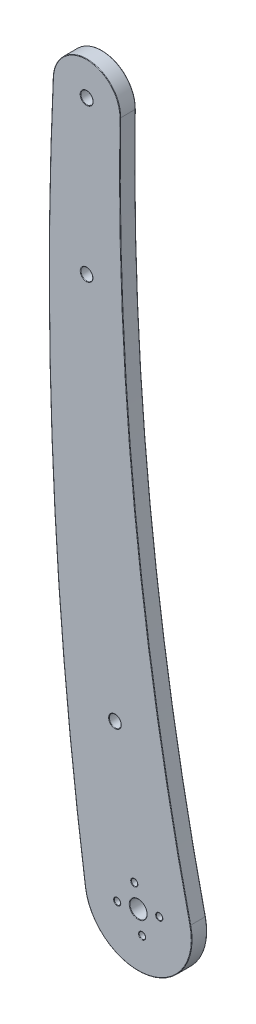
ISO-10303-21;
HEADER;
FILE_DESCRIPTION(('STEP AP214'),'2;1');
FILE_NAME('part.step','',(''),(''),'','','');
FILE_SCHEMA(('AUTOMOTIVE_DESIGN { 1 0 10303 214 1 1 1 1 }'));
ENDSEC;
DATA;
#1=APPLICATION_CONTEXT('core data for automotive mechanical design processes');
#2=APPLICATION_PROTOCOL_DEFINITION('international standard','automotive_design',2000,#1);
#3=PRODUCT_CONTEXT('',#1,'mechanical');
#4=PRODUCT('Part','Part','',(#3));
#5=PRODUCT_RELATED_PRODUCT_CATEGORY('part','',(#4));
#6=PRODUCT_DEFINITION_FORMATION('','',#4);
#7=PRODUCT_DEFINITION_CONTEXT('part definition',#1,'design');
#8=PRODUCT_DEFINITION('design','',#6,#7);
#9=PRODUCT_DEFINITION_SHAPE('','',#8);
#10=(LENGTH_UNIT() NAMED_UNIT(*) SI_UNIT(.MILLI.,.METRE.));
#11=(NAMED_UNIT(*) PLANE_ANGLE_UNIT() SI_UNIT($,.RADIAN.));
#12=(NAMED_UNIT(*) SI_UNIT($,.STERADIAN.) SOLID_ANGLE_UNIT());
#13=UNCERTAINTY_MEASURE_WITH_UNIT(LENGTH_MEASURE(1.E-05),#10,'distance_accuracy_value','');
#14=(GEOMETRIC_REPRESENTATION_CONTEXT(3) GLOBAL_UNCERTAINTY_ASSIGNED_CONTEXT((#13)) GLOBAL_UNIT_ASSIGNED_CONTEXT((#10,
#11,#12)) REPRESENTATION_CONTEXT('',''));
#15=CARTESIAN_POINT('',(0.,0.,0.));
#16=DIRECTION('',(0.,0.,1.));
#17=DIRECTION('',(1.,0.,0.));
#18=AXIS2_PLACEMENT_3D('',#15,#16,#17);
#19=CARTESIAN_POINT('',(-37.0776547455483,278.939028450343,-5.));
#20=DIRECTION('',(0.,0.,1.));
#21=DIRECTION('',(1.,0.,0.));
#22=AXIS2_PLACEMENT_3D('',#19,#20,#21);
#23=CYLINDRICAL_SURFACE('',#22,11.0000000000001);
#24=DIRECTION('',(0.,0.,1.));
#25=VECTOR('',#24,1.);
#26=CARTESIAN_POINT('',(-26.0791673880019,278.756611768298,-5.));
#27=LINE('',#26,#25);
#28=CARTESIAN_POINT('',(-26.0791673880019,278.756611768298,-4.85));
#29=VERTEX_POINT('',#28);
#30=CARTESIAN_POINT('',(-26.0791673880019,278.756611768298,-0.15));
#31=VERTEX_POINT('',#30);
#32=EDGE_CURVE('E107',#29,#31,#27,.T.);
#33=ORIENTED_EDGE('',*,*,#32,.F.);
#34=CARTESIAN_POINT('',(-37.0776547455483,278.939028450343,-4.85));
#35=DIRECTION('',(0.,0.,-1.));
#36=DIRECTION('',(-1.,0.,0.));
#37=AXIS2_PLACEMENT_3D('',#34,#35,#36);
#38=CIRCLE('',#37,11.0000000000001);
#39=CARTESIAN_POINT('',(-48.0655821267615,279.45424866073,-4.85));
#40=VERTEX_POINT('',#39);
#41=EDGE_CURVE('E102',#29,#40,#38,.F.);
#42=ORIENTED_EDGE('',*,*,#41,.T.);
#43=DIRECTION('',(0.,0.,1.));
#44=VECTOR('',#43,1.);
#45=CARTESIAN_POINT('',(-48.0655821267615,279.45424866073,-5.));
#46=LINE('',#45,#44);
#47=CARTESIAN_POINT('',(-48.0655821267615,279.45424866073,-0.15));
#48=VERTEX_POINT('',#47);
#49=EDGE_CURVE('E104',#40,#48,#46,.T.);
#50=ORIENTED_EDGE('',*,*,#49,.T.);
#51=CARTESIAN_POINT('',(-37.0776547455483,278.939028450343,-0.15));
#52=DIRECTION('',(0.,0.,-1.));
#53=DIRECTION('',(-1.,0.,0.));
#54=AXIS2_PLACEMENT_3D('',#51,#52,#53);
#55=CIRCLE('',#54,11.0000000000001);
#56=EDGE_CURVE('E113',#48,#31,#55,.T.);
#57=ORIENTED_EDGE('',*,*,#56,.T.);
#58=EDGE_LOOP('',(#33,#42,#50,#57));
#59=FACE_BOUND('',#58,.T.);
#60=ADVANCED_FACE('F36',(#59),#23,.T.);
#61=CARTESIAN_POINT('',(873.797070956716,263.831610510011,-5.));
#62=DIRECTION('',(0.,0.,1.));
#63=DIRECTION('',(1.,0.,0.));
#64=AXIS2_PLACEMENT_3D('',#61,#62,#63);
#65=CYLINDRICAL_SURFACE('',#64,900.);
#66=DIRECTION('',(0.,0.,1.));
#67=VECTOR('',#66,1.);
#68=CARTESIAN_POINT('',(-3.16790327875482,61.5139544238968,-5.));
#69=LINE('',#68,#67);
#70=CARTESIAN_POINT('',(-3.16790327875482,61.5139544238968,-4.85));
#71=VERTEX_POINT('',#70);
#72=CARTESIAN_POINT('',(-3.16790327875482,61.5139544238968,-0.15));
#73=VERTEX_POINT('',#72);
#74=EDGE_CURVE('E285',#71,#73,#69,.T.);
#75=ORIENTED_EDGE('',*,*,#74,.F.);
#76=CARTESIAN_POINT('',(873.797070956716,263.831610510011,-4.85));
#77=DIRECTION('',(0.,0.,-1.));
#78=DIRECTION('',(-1.,0.,0.));
#79=AXIS2_PLACEMENT_3D('',#76,#77,#78);
#80=CIRCLE('',#79,900.);
#81=EDGE_CURVE('E181',#71,#29,#80,.T.);
#82=ORIENTED_EDGE('',*,*,#81,.T.);
#83=ORIENTED_EDGE('',*,*,#32,.T.);
#84=CARTESIAN_POINT('',(873.797070956716,263.831610510011,-0.15));
#85=DIRECTION('',(0.,0.,-1.));
#86=DIRECTION('',(-1.,0.,0.));
#87=AXIS2_PLACEMENT_3D('',#84,#85,#86);
#88=CIRCLE('',#87,900.);
#89=EDGE_CURVE('E178',#31,#73,#88,.F.);
#90=ORIENTED_EDGE('',*,*,#89,.T.);
#91=EDGE_LOOP('',(#75,#82,#83,#90));
#92=FACE_BOUND('',#91,.T.);
#93=ADVANCED_FACE('F282',(#92),#65,.F.);
#94=CARTESIAN_POINT('',(-20.2199999999997,57.58,-5.));
#95=DIRECTION('',(0.,0.,1.));
#96=DIRECTION('',(1.,0.,0.));
#97=AXIS2_PLACEMENT_3D('',#94,#95,#96);
#98=CYLINDRICAL_SURFACE('',#97,17.4999999999997);
#99=DIRECTION('',(0.,0.,1.));
#100=VECTOR('',#99,1.);
#101=CARTESIAN_POINT('',(-37.5474034553959,55.1282476687248,-5.));
#102=LINE('',#101,#100);
#103=CARTESIAN_POINT('',(-37.5474034553959,55.1282476687248,-4.85));
#104=VERTEX_POINT('',#103);
#105=CARTESIAN_POINT('',(-37.5474034553959,55.1282476687248,-0.15));
#106=VERTEX_POINT('',#105);
#107=EDGE_CURVE('E124',#104,#106,#102,.T.);
#108=ORIENTED_EDGE('',*,*,#107,.F.);
#109=CARTESIAN_POINT('',(-20.2199999999997,57.58,-4.85));
#110=DIRECTION('',(0.,0.,-1.));
#111=DIRECTION('',(-1.,0.,0.));
#112=AXIS2_PLACEMENT_3D('',#109,#110,#111);
#113=CIRCLE('',#112,17.4999999999997);
#114=EDGE_CURVE('E176',#104,#71,#113,.F.);
#115=ORIENTED_EDGE('',*,*,#114,.T.);
#116=ORIENTED_EDGE('',*,*,#74,.T.);
#117=CARTESIAN_POINT('',(-20.2199999999997,57.58,-0.15));
#118=DIRECTION('',(0.,0.,-1.));
#119=DIRECTION('',(-1.,0.,0.));
#120=AXIS2_PLACEMENT_3D('',#117,#118,#119);
#121=CIRCLE('',#120,17.4999999999997);
#122=EDGE_CURVE('E174',#73,#106,#121,.T.);
#123=ORIENTED_EDGE('',*,*,#122,.T.);
#124=EDGE_LOOP('',(#108,#115,#116,#123));
#125=FACE_BOUND('',#124,.T.);
#126=ADVANCED_FACE('F337',(#125),#98,.T.);
#127=CARTESIAN_POINT('',(1150.61740491465,223.248407527602,-5.));
#128=DIRECTION('',(0.,0.,1.));
#129=DIRECTION('',(1.,0.,0.));
#130=AXIS2_PLACEMENT_3D('',#127,#128,#129);
#131=CYLINDRICAL_SURFACE('',#130,1200.);
#132=ORIENTED_EDGE('',*,*,#49,.F.);
#133=CARTESIAN_POINT('',(1150.61740491465,223.248407527602,-4.85));
#134=DIRECTION('',(0.,0.,-1.));
#135=DIRECTION('',(-1.,0.,0.));
#136=AXIS2_PLACEMENT_3D('',#133,#134,#135);
#137=CIRCLE('',#136,1200.);
#138=EDGE_CURVE('E120',#40,#104,#137,.F.);
#139=ORIENTED_EDGE('',*,*,#138,.T.);
#140=ORIENTED_EDGE('',*,*,#107,.T.);
#141=CARTESIAN_POINT('',(1150.61740491465,223.248407527602,-0.15));
#142=DIRECTION('',(0.,0.,-1.));
#143=DIRECTION('',(-1.,0.,0.));
#144=AXIS2_PLACEMENT_3D('',#141,#142,#143);
#145=CIRCLE('',#144,1200.);
#146=EDGE_CURVE('E123',#106,#48,#145,.T.);
#147=ORIENTED_EDGE('',*,*,#146,.T.);
#148=EDGE_LOOP('',(#132,#139,#140,#147));
#149=FACE_BOUND('',#148,.T.);
#150=ADVANCED_FACE('F117',(#149),#131,.T.);
#151=CARTESIAN_POINT('',(418.359708105584,271.385319480177,-5.));
#152=DIRECTION('',(0.,0.,-1.));
#153=DIRECTION('',(-1.,0.,0.));
#154=AXIS2_PLACEMENT_3D('',#151,#152,#153);
#155=PLANE('',#154);
#156=CARTESIAN_POINT('',(-20.2199999999997,57.58,-5.));
#157=DIRECTION('',(0.,0.,-1.));
#158=DIRECTION('',(-1.,0.,0.));
#159=AXIS2_PLACEMENT_3D('',#156,#157,#158);
#160=CIRCLE('',#159,17.3499999999997);
#161=CARTESIAN_POINT('',(-3.31406410779405,61.4802348145491,-5.));
#162=VERTEX_POINT('',#161);
#163=CARTESIAN_POINT('',(-37.3988828543496,55.1492626887071,-5.));
#164=VERTEX_POINT('',#163);
#165=EDGE_CURVE('E170',#162,#164,#160,.T.);
#166=ORIENTED_EDGE('',*,*,#165,.T.);
#167=CARTESIAN_POINT('',(1150.61740491465,223.248407527602,-5.));
#168=DIRECTION('',(0.,0.,-1.));
#169=DIRECTION('',(-1.,0.,0.));
#170=AXIS2_PLACEMENT_3D('',#167,#168,#169);
#171=CIRCLE('',#170,1199.85);
#172=CARTESIAN_POINT('',(-47.9157467533811,279.447222930589,-5.));
#173=VERTEX_POINT('',#172);
#174=EDGE_CURVE('E172',#164,#173,#171,.T.);
#175=ORIENTED_EDGE('',*,*,#174,.T.);
#176=CARTESIAN_POINT('',(-37.0776547455483,278.939028450343,-5.));
#177=DIRECTION('',(0.,0.,-1.));
#178=DIRECTION('',(-1.,0.,0.));
#179=AXIS2_PLACEMENT_3D('',#176,#177,#178);
#180=CIRCLE('',#179,10.8500000000001);
#181=CARTESIAN_POINT('',(-26.2291467610591,278.759099268507,-5.));
#182=VERTEX_POINT('',#181);
#183=EDGE_CURVE('E130',#173,#182,#180,.T.);
#184=ORIENTED_EDGE('',*,*,#183,.T.);
#185=CARTESIAN_POINT('',(873.797070956716,263.831610510011,-5.));
#186=DIRECTION('',(0.,0.,-1.));
#187=DIRECTION('',(-1.,0.,0.));
#188=AXIS2_PLACEMENT_3D('',#185,#186,#187);
#189=CIRCLE('',#188,900.15);
#190=EDGE_CURVE('E168',#182,#162,#189,.F.);
#191=ORIENTED_EDGE('',*,*,#190,.T.);
#192=EDGE_LOOP('',(#166,#175,#184,#191));
#193=FACE_BOUND('',#192,.T.);
#194=CARTESIAN_POINT('',(-20.2199999999997,57.58,-5.));
#195=DIRECTION('',(0.,0.,-1.));
#196=DIRECTION('',(-1.,0.,0.));
#197=AXIS2_PLACEMENT_3D('',#194,#195,#196);
#198=CIRCLE('',#197,2.95);
#199=CARTESIAN_POINT('',(-23.1699999999997,57.58,-5.));
#200=VERTEX_POINT('',#199);
#201=EDGE_CURVE('E164',#200,#200,#198,.F.);
#202=ORIENTED_EDGE('',*,*,#201,.T.);
#203=EDGE_LOOP('',(#202));
#204=FACE_BOUND('',#203,.T.);
#205=CARTESIAN_POINT('',(-37.0776547455483,278.939028450343,-5.));
#206=DIRECTION('',(0.,0.,-1.));
#207=DIRECTION('',(-1.,0.,0.));
#208=AXIS2_PLACEMENT_3D('',#205,#206,#207);
#209=CIRCLE('',#208,2.15);
#210=CARTESIAN_POINT('',(-39.2276547455483,278.939028450343,-5.));
#211=VERTEX_POINT('',#210);
#212=EDGE_CURVE('E161',#211,#211,#209,.F.);
#213=ORIENTED_EDGE('',*,*,#212,.T.);
#214=EDGE_LOOP('',(#213));
#215=FACE_BOUND('',#214,.T.);
#216=CARTESIAN_POINT('',(-27.8210123611365,106.998868978214,-5.));
#217=DIRECTION('',(0.,0.,-1.));
#218=DIRECTION('',(-1.,0.,0.));
#219=AXIS2_PLACEMENT_3D('',#216,#217,#218);
#220=CIRCLE('',#219,2.1);
#221=CARTESIAN_POINT('',(-29.9210123611365,106.998868978214,-5.));
#222=VERTEX_POINT('',#221);
#223=EDGE_CURVE('E158',#222,#222,#220,.F.);
#224=ORIENTED_EDGE('',*,*,#223,.T.);
#225=EDGE_LOOP('',(#224));
#226=FACE_BOUND('',#225,.T.);
#227=CARTESIAN_POINT('',(-37.1073977935269,228.939037296833,-5.));
#228=DIRECTION('',(0.,0.,-1.));
#229=DIRECTION('',(-1.,0.,0.));
#230=AXIS2_PLACEMENT_3D('',#227,#228,#229);
#231=CIRCLE('',#230,2.1);
#232=CARTESIAN_POINT('',(-39.2073977935269,228.939037296833,-5.));
#233=VERTEX_POINT('',#232);
#234=EDGE_CURVE('E155',#233,#233,#231,.F.);
#235=ORIENTED_EDGE('',*,*,#234,.T.);
#236=EDGE_LOOP('',(#235));
#237=FACE_BOUND('',#236,.T.);
#238=CARTESIAN_POINT('',(-18.9416722711145,50.6977127190473,-5.));
#239=DIRECTION('',(0.,0.,-1.));
#240=DIRECTION('',(-1.,0.,0.));
#241=AXIS2_PLACEMENT_3D('',#238,#239,#240);
#242=CIRCLE('',#241,1.2);
#243=CARTESIAN_POINT('',(-20.1416722711145,50.6977127190473,-5.));
#244=VERTEX_POINT('',#243);
#245=EDGE_CURVE('E152',#244,#244,#242,.F.);
#246=ORIENTED_EDGE('',*,*,#245,.T.);
#247=EDGE_LOOP('',(#246));
#248=FACE_BOUND('',#247,.T.);
#249=CARTESIAN_POINT('',(-27.1022872809524,56.3016722711148,-5.));
#250=DIRECTION('',(0.,0.,-1.));
#251=DIRECTION('',(-1.,0.,0.));
#252=AXIS2_PLACEMENT_3D('',#249,#250,#251);
#253=CIRCLE('',#252,1.2);
#254=CARTESIAN_POINT('',(-28.3022872809524,56.3016722711148,-5.));
#255=VERTEX_POINT('',#254);
#256=EDGE_CURVE('E149',#255,#255,#253,.F.);
#257=ORIENTED_EDGE('',*,*,#256,.T.);
#258=EDGE_LOOP('',(#257));
#259=FACE_BOUND('',#258,.T.);
#260=CARTESIAN_POINT('',(-21.4983277288849,64.4622872809527,-5.));
#261=DIRECTION('',(0.,0.,-1.));
#262=DIRECTION('',(-1.,0.,0.));
#263=AXIS2_PLACEMENT_3D('',#260,#261,#262);
#264=CIRCLE('',#263,1.2);
#265=CARTESIAN_POINT('',(-22.6983277288849,64.4622872809527,-5.));
#266=VERTEX_POINT('',#265);
#267=EDGE_CURVE('E143',#266,#266,#264,.F.);
#268=ORIENTED_EDGE('',*,*,#267,.T.);
#269=EDGE_LOOP('',(#268));
#270=FACE_BOUND('',#269,.T.);
#271=CARTESIAN_POINT('',(-13.337712719047,58.8583277288852,-5.));
#272=DIRECTION('',(0.,0.,-1.));
#273=DIRECTION('',(-1.,0.,0.));
#274=AXIS2_PLACEMENT_3D('',#271,#272,#273);
#275=CIRCLE('',#274,1.2);
#276=CARTESIAN_POINT('',(-14.537712719047,58.8583277288852,-5.));
#277=VERTEX_POINT('',#276);
#278=EDGE_CURVE('E140',#277,#277,#275,.F.);
#279=ORIENTED_EDGE('',*,*,#278,.T.);
#280=EDGE_LOOP('',(#279));
#281=FACE_BOUND('',#280,.T.);
#282=ADVANCED_FACE('F294',(#193,#204,#215,#226,#237,#248,#259,#270,#281),#155,.T.);
#283=CARTESIAN_POINT('',(418.359708105584,271.385319480177,0.));
#284=DIRECTION('',(0.,0.,-1.));
#285=DIRECTION('',(-1.,0.,0.));
#286=AXIS2_PLACEMENT_3D('',#283,#284,#285);
#287=PLANE('',#286);
#288=CARTESIAN_POINT('',(-20.2199999999997,57.58,0.));
#289=DIRECTION('',(0.,0.,-1.));
#290=DIRECTION('',(-1.,0.,0.));
#291=AXIS2_PLACEMENT_3D('',#288,#289,#290);
#292=CIRCLE('',#291,17.3499999999997);
#293=CARTESIAN_POINT('',(-37.3988828543499,55.1492626887071,0.));
#294=VERTEX_POINT('',#293);
#295=CARTESIAN_POINT('',(-3.31406410779405,61.4802348145491,0.));
#296=VERTEX_POINT('',#295);
#297=EDGE_CURVE('E45',#294,#296,#292,.F.);
#298=ORIENTED_EDGE('',*,*,#297,.T.);
#299=CARTESIAN_POINT('',(873.797070956716,263.831610510011,0.));
#300=DIRECTION('',(0.,0.,-1.));
#301=DIRECTION('',(-1.,0.,0.));
#302=AXIS2_PLACEMENT_3D('',#299,#300,#301);
#303=CIRCLE('',#302,900.15);
#304=CARTESIAN_POINT('',(-26.2291467610591,278.759099268507,0.));
#305=VERTEX_POINT('',#304);
#306=EDGE_CURVE('E11',#296,#305,#303,.T.);
#307=ORIENTED_EDGE('',*,*,#306,.T.);
#308=CARTESIAN_POINT('',(-37.0776547455483,278.939028450343,0.));
#309=DIRECTION('',(0.,0.,-1.));
#310=DIRECTION('',(-1.,0.,0.));
#311=AXIS2_PLACEMENT_3D('',#308,#309,#310);
#312=CIRCLE('',#311,10.8500000000001);
#313=CARTESIAN_POINT('',(-47.9157467533811,279.447222930589,0.));
#314=VERTEX_POINT('',#313);
#315=EDGE_CURVE('E255',#305,#314,#312,.F.);
#316=ORIENTED_EDGE('',*,*,#315,.T.);
#317=CARTESIAN_POINT('',(1150.61740491465,223.248407527602,0.));
#318=DIRECTION('',(0.,0.,-1.));
#319=DIRECTION('',(-1.,0.,0.));
#320=AXIS2_PLACEMENT_3D('',#317,#318,#319);
#321=CIRCLE('',#320,1199.85);
#322=EDGE_CURVE('E56',#314,#294,#321,.F.);
#323=ORIENTED_EDGE('',*,*,#322,.T.);
#324=EDGE_LOOP('',(#298,#307,#316,#323));
#325=FACE_BOUND('',#324,.T.);
#326=CARTESIAN_POINT('',(-20.2199999999997,57.58,0.));
#327=DIRECTION('',(0.,0.,-1.));
#328=DIRECTION('',(-1.,0.,0.));
#329=AXIS2_PLACEMENT_3D('',#326,#327,#328);
#330=CIRCLE('',#329,2.95);
#331=CARTESIAN_POINT('',(-23.1699999999997,57.58,0.));
#332=VERTEX_POINT('',#331);
#333=EDGE_CURVE('E252',#332,#332,#330,.T.);
#334=ORIENTED_EDGE('',*,*,#333,.T.);
#335=EDGE_LOOP('',(#334));
#336=FACE_BOUND('',#335,.T.);
#337=CARTESIAN_POINT('',(-37.0776547455483,278.939028450343,0.));
#338=DIRECTION('',(0.,0.,-1.));
#339=DIRECTION('',(-1.,0.,0.));
#340=AXIS2_PLACEMENT_3D('',#337,#338,#339);
#341=CIRCLE('',#340,2.15);
#342=CARTESIAN_POINT('',(-39.2276547455483,278.939028450343,0.));
#343=VERTEX_POINT('',#342);
#344=EDGE_CURVE('E249',#343,#343,#341,.T.);
#345=ORIENTED_EDGE('',*,*,#344,.T.);
#346=EDGE_LOOP('',(#345));
#347=FACE_BOUND('',#346,.T.);
#348=CARTESIAN_POINT('',(-27.8210123611365,106.998868978214,0.));
#349=DIRECTION('',(0.,0.,-1.));
#350=DIRECTION('',(-1.,0.,0.));
#351=AXIS2_PLACEMENT_3D('',#348,#349,#350);
#352=CIRCLE('',#351,2.1);
#353=CARTESIAN_POINT('',(-29.9210123611365,106.998868978214,0.));
#354=VERTEX_POINT('',#353);
#355=EDGE_CURVE('E246',#354,#354,#352,.T.);
#356=ORIENTED_EDGE('',*,*,#355,.T.);
#357=EDGE_LOOP('',(#356));
#358=FACE_BOUND('',#357,.T.);
#359=CARTESIAN_POINT('',(-37.1073977935269,228.939037296833,0.));
#360=DIRECTION('',(0.,0.,-1.));
#361=DIRECTION('',(-1.,0.,0.));
#362=AXIS2_PLACEMENT_3D('',#359,#360,#361);
#363=CIRCLE('',#362,2.1);
#364=CARTESIAN_POINT('',(-39.2073977935269,228.939037296833,0.));
#365=VERTEX_POINT('',#364);
#366=EDGE_CURVE('E243',#365,#365,#363,.T.);
#367=ORIENTED_EDGE('',*,*,#366,.T.);
#368=EDGE_LOOP('',(#367));
#369=FACE_BOUND('',#368,.T.);
#370=CARTESIAN_POINT('',(-18.9416722711145,50.6977127190473,0.));
#371=DIRECTION('',(0.,0.,-1.));
#372=DIRECTION('',(-1.,0.,0.));
#373=AXIS2_PLACEMENT_3D('',#370,#371,#372);
#374=CIRCLE('',#373,1.2);
#375=CARTESIAN_POINT('',(-20.1416722711145,50.6977127190473,0.));
#376=VERTEX_POINT('',#375);
#377=EDGE_CURVE('E240',#376,#376,#374,.T.);
#378=ORIENTED_EDGE('',*,*,#377,.T.);
#379=EDGE_LOOP('',(#378));
#380=FACE_BOUND('',#379,.T.);
#381=CARTESIAN_POINT('',(-27.1022872809524,56.3016722711148,0.));
#382=DIRECTION('',(0.,0.,-1.));
#383=DIRECTION('',(-1.,0.,0.));
#384=AXIS2_PLACEMENT_3D('',#381,#382,#383);
#385=CIRCLE('',#384,1.2);
#386=CARTESIAN_POINT('',(-28.3022872809524,56.3016722711148,0.));
#387=VERTEX_POINT('',#386);
#388=EDGE_CURVE('E237',#387,#387,#385,.T.);
#389=ORIENTED_EDGE('',*,*,#388,.T.);
#390=EDGE_LOOP('',(#389));
#391=FACE_BOUND('',#390,.T.);
#392=CARTESIAN_POINT('',(-21.4983277288849,64.4622872809527,0.));
#393=DIRECTION('',(0.,0.,-1.));
#394=DIRECTION('',(-1.,0.,0.));
#395=AXIS2_PLACEMENT_3D('',#392,#393,#394);
#396=CIRCLE('',#395,1.2);
#397=CARTESIAN_POINT('',(-22.6983277288849,64.4622872809527,0.));
#398=VERTEX_POINT('',#397);
#399=EDGE_CURVE('E234',#398,#398,#396,.T.);
#400=ORIENTED_EDGE('',*,*,#399,.T.);
#401=EDGE_LOOP('',(#400));
#402=FACE_BOUND('',#401,.T.);
#403=CARTESIAN_POINT('',(-13.337712719047,58.8583277288852,0.));
#404=DIRECTION('',(0.,0.,-1.));
#405=DIRECTION('',(-1.,0.,0.));
#406=AXIS2_PLACEMENT_3D('',#403,#404,#405);
#407=CIRCLE('',#406,1.2);
#408=CARTESIAN_POINT('',(-14.537712719047,58.8583277288852,0.));
#409=VERTEX_POINT('',#408);
#410=EDGE_CURVE('E231',#409,#409,#407,.T.);
#411=ORIENTED_EDGE('',*,*,#410,.T.);
#412=EDGE_LOOP('',(#411));
#413=FACE_BOUND('',#412,.T.);
#414=ADVANCED_FACE('F290',(#325,#336,#347,#358,#369,#380,#391,#402,#413),#287,.F.);
#415=CARTESIAN_POINT('',(-20.2199999999997,57.58,-5.));
#416=DIRECTION('',(0.,0.,1.));
#417=DIRECTION('',(1.,0.,0.));
#418=AXIS2_PLACEMENT_3D('',#415,#416,#417);
#419=CYLINDRICAL_SURFACE('',#418,2.8);
#420=CARTESIAN_POINT('',(-20.2199999999997,57.58,-4.85));
#421=DIRECTION('',(0.,0.,-1.));
#422=DIRECTION('',(-1.,0.,0.));
#423=AXIS2_PLACEMENT_3D('',#420,#421,#422);
#424=CIRCLE('',#423,2.8);
#425=CARTESIAN_POINT('',(-23.0199999999997,57.58,-4.85));
#426=VERTEX_POINT('',#425);
#427=EDGE_CURVE('E186',#426,#426,#424,.T.);
#428=ORIENTED_EDGE('',*,*,#427,.T.);
#429=EDGE_LOOP('',(#428));
#430=FACE_BOUND('',#429,.T.);
#431=CARTESIAN_POINT('',(-20.2199999999997,57.58,-0.15));
#432=DIRECTION('',(0.,0.,-1.));
#433=DIRECTION('',(-1.,0.,0.));
#434=AXIS2_PLACEMENT_3D('',#431,#432,#433);
#435=CIRCLE('',#434,2.8);
#436=CARTESIAN_POINT('',(-23.0199999999997,57.58,-0.15));
#437=VERTEX_POINT('',#436);
#438=EDGE_CURVE('E112',#437,#437,#435,.F.);
#439=ORIENTED_EDGE('',*,*,#438,.T.);
#440=EDGE_LOOP('',(#439));
#441=FACE_BOUND('',#440,.T.);
#442=ADVANCED_FACE('F293',(#430,#441),#419,.F.);
#443=CARTESIAN_POINT('',(-37.0776547455483,278.939028450343,-5.));
#444=DIRECTION('',(0.,0.,1.));
#445=DIRECTION('',(1.,0.,0.));
#446=AXIS2_PLACEMENT_3D('',#443,#444,#445);
#447=CYLINDRICAL_SURFACE('',#446,2.);
#448=CARTESIAN_POINT('',(-37.0776547455483,278.939028450343,-4.85));
#449=DIRECTION('',(0.,0.,-1.));
#450=DIRECTION('',(-1.,0.,0.));
#451=AXIS2_PLACEMENT_3D('',#448,#449,#450);
#452=CIRCLE('',#451,2.);
#453=CARTESIAN_POINT('',(-39.0776547455483,278.939028450343,-4.85));
#454=VERTEX_POINT('',#453);
#455=EDGE_CURVE('E192',#454,#454,#452,.T.);
#456=ORIENTED_EDGE('',*,*,#455,.T.);
#457=EDGE_LOOP('',(#456));
#458=FACE_BOUND('',#457,.T.);
#459=CARTESIAN_POINT('',(-37.0776547455483,278.939028450343,-0.15));
#460=DIRECTION('',(0.,0.,-1.));
#461=DIRECTION('',(-1.,0.,0.));
#462=AXIS2_PLACEMENT_3D('',#459,#460,#461);
#463=CIRCLE('',#462,2.);
#464=CARTESIAN_POINT('',(-39.0776547455483,278.939028450343,-0.15));
#465=VERTEX_POINT('',#464);
#466=EDGE_CURVE('E189',#465,#465,#463,.F.);
#467=ORIENTED_EDGE('',*,*,#466,.T.);
#468=EDGE_LOOP('',(#467));
#469=FACE_BOUND('',#468,.T.);
#470=ADVANCED_FACE('F583',(#458,#469),#447,.F.);
#471=CARTESIAN_POINT('',(-27.8210123611365,106.998868978214,-5.));
#472=DIRECTION('',(0.,0.,1.));
#473=DIRECTION('',(1.,0.,0.));
#474=AXIS2_PLACEMENT_3D('',#471,#472,#473);
#475=CYLINDRICAL_SURFACE('',#474,1.95);
#476=CARTESIAN_POINT('',(-27.8210123611365,106.998868978214,-4.85));
#477=DIRECTION('',(0.,0.,-1.));
#478=DIRECTION('',(-1.,0.,0.));
#479=AXIS2_PLACEMENT_3D('',#476,#477,#478);
#480=CIRCLE('',#479,1.95);
#481=CARTESIAN_POINT('',(-29.7710123611365,106.998868978214,-4.85));
#482=VERTEX_POINT('',#481);
#483=EDGE_CURVE('E198',#482,#482,#480,.T.);
#484=ORIENTED_EDGE('',*,*,#483,.T.);
#485=EDGE_LOOP('',(#484));
#486=FACE_BOUND('',#485,.T.);
#487=CARTESIAN_POINT('',(-27.8210123611365,106.998868978214,-0.15));
#488=DIRECTION('',(0.,0.,-1.));
#489=DIRECTION('',(-1.,0.,0.));
#490=AXIS2_PLACEMENT_3D('',#487,#488,#489);
#491=CIRCLE('',#490,1.95);
#492=CARTESIAN_POINT('',(-29.7710123611365,106.998868978214,-0.15));
#493=VERTEX_POINT('',#492);
#494=EDGE_CURVE('E195',#493,#493,#491,.F.);
#495=ORIENTED_EDGE('',*,*,#494,.T.);
#496=EDGE_LOOP('',(#495));
#497=FACE_BOUND('',#496,.T.);
#498=ADVANCED_FACE('F574',(#486,#497),#475,.F.);
#499=CARTESIAN_POINT('',(-37.1073977935269,228.939037296833,-5.));
#500=DIRECTION('',(0.,0.,1.));
#501=DIRECTION('',(1.,0.,0.));
#502=AXIS2_PLACEMENT_3D('',#499,#500,#501);
#503=CYLINDRICAL_SURFACE('',#502,1.95);
#504=CARTESIAN_POINT('',(-37.1073977935269,228.939037296833,-4.85));
#505=DIRECTION('',(0.,0.,-1.));
#506=DIRECTION('',(-1.,0.,0.));
#507=AXIS2_PLACEMENT_3D('',#504,#505,#506);
#508=CIRCLE('',#507,1.95);
#509=CARTESIAN_POINT('',(-39.0573977935269,228.939037296833,-4.85));
#510=VERTEX_POINT('',#509);
#511=EDGE_CURVE('E204',#510,#510,#508,.T.);
#512=ORIENTED_EDGE('',*,*,#511,.T.);
#513=EDGE_LOOP('',(#512));
#514=FACE_BOUND('',#513,.T.);
#515=CARTESIAN_POINT('',(-37.1073977935269,228.939037296833,-0.15));
#516=DIRECTION('',(0.,0.,-1.));
#517=DIRECTION('',(-1.,0.,0.));
#518=AXIS2_PLACEMENT_3D('',#515,#516,#517);
#519=CIRCLE('',#518,1.95);
#520=CARTESIAN_POINT('',(-39.0573977935269,228.939037296833,-0.15));
#521=VERTEX_POINT('',#520);
#522=EDGE_CURVE('E201',#521,#521,#519,.F.);
#523=ORIENTED_EDGE('',*,*,#522,.T.);
#524=EDGE_LOOP('',(#523));
#525=FACE_BOUND('',#524,.T.);
#526=ADVANCED_FACE('F565',(#514,#525),#503,.F.);
#527=CARTESIAN_POINT('',(-18.9416722711145,50.6977127190473,-5.));
#528=DIRECTION('',(0.,0.,1.));
#529=DIRECTION('',(1.,0.,0.));
#530=AXIS2_PLACEMENT_3D('',#527,#528,#529);
#531=CYLINDRICAL_SURFACE('',#530,1.05);
#532=CARTESIAN_POINT('',(-18.9416722711145,50.6977127190473,-4.85));
#533=DIRECTION('',(0.,0.,-1.));
#534=DIRECTION('',(-1.,0.,0.));
#535=AXIS2_PLACEMENT_3D('',#532,#533,#534);
#536=CIRCLE('',#535,1.05);
#537=CARTESIAN_POINT('',(-19.9916722711145,50.6977127190473,-4.85));
#538=VERTEX_POINT('',#537);
#539=EDGE_CURVE('E210',#538,#538,#536,.T.);
#540=ORIENTED_EDGE('',*,*,#539,.T.);
#541=EDGE_LOOP('',(#540));
#542=FACE_BOUND('',#541,.T.);
#543=CARTESIAN_POINT('',(-18.9416722711145,50.6977127190473,-0.15));
#544=DIRECTION('',(0.,0.,-1.));
#545=DIRECTION('',(-1.,0.,0.));
#546=AXIS2_PLACEMENT_3D('',#543,#544,#545);
#547=CIRCLE('',#546,1.05);
#548=CARTESIAN_POINT('',(-19.9916722711145,50.6977127190473,-0.15));
#549=VERTEX_POINT('',#548);
#550=EDGE_CURVE('E207',#549,#549,#547,.F.);
#551=ORIENTED_EDGE('',*,*,#550,.T.);
#552=EDGE_LOOP('',(#551));
#553=FACE_BOUND('',#552,.T.);
#554=ADVANCED_FACE('F556',(#542,#553),#531,.F.);
#555=CARTESIAN_POINT('',(-27.1022872809524,56.3016722711148,-5.));
#556=DIRECTION('',(0.,0.,1.));
#557=DIRECTION('',(1.,0.,0.));
#558=AXIS2_PLACEMENT_3D('',#555,#556,#557);
#559=CYLINDRICAL_SURFACE('',#558,1.05);
#560=CARTESIAN_POINT('',(-27.1022872809524,56.3016722711148,-4.85));
#561=DIRECTION('',(0.,0.,-1.));
#562=DIRECTION('',(-1.,0.,0.));
#563=AXIS2_PLACEMENT_3D('',#560,#561,#562);
#564=CIRCLE('',#563,1.05);
#565=CARTESIAN_POINT('',(-28.1522872809524,56.3016722711148,-4.85));
#566=VERTEX_POINT('',#565);
#567=EDGE_CURVE('E216',#566,#566,#564,.T.);
#568=ORIENTED_EDGE('',*,*,#567,.T.);
#569=EDGE_LOOP('',(#568));
#570=FACE_BOUND('',#569,.T.);
#571=CARTESIAN_POINT('',(-27.1022872809524,56.3016722711148,-0.15));
#572=DIRECTION('',(0.,0.,-1.));
#573=DIRECTION('',(-1.,0.,0.));
#574=AXIS2_PLACEMENT_3D('',#571,#572,#573);
#575=CIRCLE('',#574,1.05);
#576=CARTESIAN_POINT('',(-28.1522872809524,56.3016722711148,-0.15));
#577=VERTEX_POINT('',#576);
#578=EDGE_CURVE('E213',#577,#577,#575,.F.);
#579=ORIENTED_EDGE('',*,*,#578,.T.);
#580=EDGE_LOOP('',(#579));
#581=FACE_BOUND('',#580,.T.);
#582=ADVANCED_FACE('F329',(#570,#581),#559,.F.);
#583=CARTESIAN_POINT('',(-21.4983277288849,64.4622872809527,-5.));
#584=DIRECTION('',(0.,0.,1.));
#585=DIRECTION('',(1.,0.,0.));
#586=AXIS2_PLACEMENT_3D('',#583,#584,#585);
#587=CYLINDRICAL_SURFACE('',#586,1.05);
#588=CARTESIAN_POINT('',(-21.4983277288849,64.4622872809527,-4.85));
#589=DIRECTION('',(0.,0.,-1.));
#590=DIRECTION('',(-1.,0.,0.));
#591=AXIS2_PLACEMENT_3D('',#588,#589,#590);
#592=CIRCLE('',#591,1.05);
#593=CARTESIAN_POINT('',(-22.5483277288849,64.4622872809527,-4.85));
#594=VERTEX_POINT('',#593);
#595=EDGE_CURVE('E222',#594,#594,#592,.T.);
#596=ORIENTED_EDGE('',*,*,#595,.T.);
#597=EDGE_LOOP('',(#596));
#598=FACE_BOUND('',#597,.T.);
#599=CARTESIAN_POINT('',(-21.4983277288849,64.4622872809527,-0.15));
#600=DIRECTION('',(0.,0.,-1.));
#601=DIRECTION('',(-1.,0.,0.));
#602=AXIS2_PLACEMENT_3D('',#599,#600,#601);
#603=CIRCLE('',#602,1.05);
#604=CARTESIAN_POINT('',(-22.5483277288849,64.4622872809527,-0.15));
#605=VERTEX_POINT('',#604);
#606=EDGE_CURVE('E219',#605,#605,#603,.F.);
#607=ORIENTED_EDGE('',*,*,#606,.T.);
#608=EDGE_LOOP('',(#607));
#609=FACE_BOUND('',#608,.T.);
#610=ADVANCED_FACE('F320',(#598,#609),#587,.F.);
#611=CARTESIAN_POINT('',(-13.337712719047,58.8583277288852,-5.));
#612=DIRECTION('',(0.,0.,1.));
#613=DIRECTION('',(1.,0.,0.));
#614=AXIS2_PLACEMENT_3D('',#611,#612,#613);
#615=CYLINDRICAL_SURFACE('',#614,1.05);
#616=CARTESIAN_POINT('',(-13.337712719047,58.8583277288852,-4.85));
#617=DIRECTION('',(0.,0.,-1.));
#618=DIRECTION('',(-1.,0.,0.));
#619=AXIS2_PLACEMENT_3D('',#616,#617,#618);
#620=CIRCLE('',#619,1.05);
#621=CARTESIAN_POINT('',(-14.387712719047,58.8583277288852,-4.85));
#622=VERTEX_POINT('',#621);
#623=EDGE_CURVE('E228',#622,#622,#620,.T.);
#624=ORIENTED_EDGE('',*,*,#623,.T.);
#625=EDGE_LOOP('',(#624));
#626=FACE_BOUND('',#625,.T.);
#627=CARTESIAN_POINT('',(-13.337712719047,58.8583277288852,-0.15));
#628=DIRECTION('',(0.,0.,-1.));
#629=DIRECTION('',(-1.,0.,0.));
#630=AXIS2_PLACEMENT_3D('',#627,#628,#629);
#631=CIRCLE('',#630,1.05);
#632=CARTESIAN_POINT('',(-14.387712719047,58.8583277288852,-0.15));
#633=VERTEX_POINT('',#632);
#634=EDGE_CURVE('E225',#633,#633,#631,.F.);
#635=ORIENTED_EDGE('',*,*,#634,.T.);
#636=EDGE_LOOP('',(#635));
#637=FACE_BOUND('',#636,.T.);
#638=ADVANCED_FACE('F317',(#626,#637),#615,.F.);
#639=CARTESIAN_POINT('',(873.797070956716,263.831610510011,-4.85));
#640=DIRECTION('',(0.,0.,-1.));
#641=DIRECTION('',(-1.,0.,0.));
#642=AXIS2_PLACEMENT_3D('',#639,#640,#641);
#643=TOROIDAL_SURFACE('',#642,900.15,0.15);
#644=CARTESIAN_POINT('',(-3.31406410779405,61.4802348145491,-4.85));
#645=DIRECTION('',(0.224797395651233,-0.974405526928302,0.));
#646=DIRECTION('',(0.974405526928303,0.224797395651233,0.));
#647=AXIS2_PLACEMENT_3D('',#644,#645,#646);
#648=CIRCLE('',#647,0.15);
#649=EDGE_CURVE('E134',#162,#71,#648,.T.);
#650=ORIENTED_EDGE('',*,*,#649,.F.);
#651=ORIENTED_EDGE('',*,*,#190,.F.);
#652=CARTESIAN_POINT('',(-26.2291467610593,278.759099268507,-4.85));
#653=DIRECTION('',(0.0165833347313496,0.999862487049688,0.));
#654=DIRECTION('',(-0.999862487049688,0.0165833347313496,0.));
#655=AXIS2_PLACEMENT_3D('',#652,#653,#654);
#656=CIRCLE('',#655,0.15);
#657=EDGE_CURVE('E125',#29,#182,#656,.T.);
#658=ORIENTED_EDGE('',*,*,#657,.F.);
#659=ORIENTED_EDGE('',*,*,#81,.F.);
#660=EDGE_LOOP('',(#650,#651,#658,#659));
#661=FACE_BOUND('',#660,.T.);
#662=ADVANCED_FACE('F319',(#661),#643,.T.);
#663=CARTESIAN_POINT('',(-37.0776547455483,278.939028450343,-4.85));
#664=DIRECTION('',(0.,0.,-1.));
#665=DIRECTION('',(-1.,0.,0.));
#666=AXIS2_PLACEMENT_3D('',#663,#664,#665);
#667=TOROIDAL_SURFACE('',#666,10.8500000000001,0.15);
#668=ORIENTED_EDGE('',*,*,#657,.T.);
#669=ORIENTED_EDGE('',*,*,#183,.F.);
#670=CARTESIAN_POINT('',(-47.9157467533811,279.447222930589,-4.85));
#671=DIRECTION('',(-0.0468382009444214,-0.998902489201168,0.));
#672=DIRECTION('',(0.998902489201168,-0.0468382009444214,0.));
#673=AXIS2_PLACEMENT_3D('',#670,#671,#672);
#674=CIRCLE('',#673,0.15);
#675=EDGE_CURVE('E128',#40,#173,#674,.T.);
#676=ORIENTED_EDGE('',*,*,#675,.F.);
#677=ORIENTED_EDGE('',*,*,#41,.F.);
#678=EDGE_LOOP('',(#668,#669,#676,#677));
#679=FACE_BOUND('',#678,.T.);
#680=ADVANCED_FACE('F129',(#679),#667,.T.);
#681=CARTESIAN_POINT('',(-20.2199999999997,57.58,-4.85));
#682=DIRECTION('',(0.,0.,-1.));
#683=DIRECTION('',(-1.,0.,0.));
#684=AXIS2_PLACEMENT_3D('',#681,#682,#683);
#685=TOROIDAL_SURFACE('',#684,17.3499999999997,0.15);
#686=ORIENTED_EDGE('',*,*,#649,.T.);
#687=ORIENTED_EDGE('',*,*,#114,.F.);
#688=CARTESIAN_POINT('',(-37.3988828543496,55.1492626887071,-4.85));
#689=DIRECTION('',(-0.140100133215795,0.990137340308362,0.));
#690=DIRECTION('',(-0.990137340308362,-0.140100133215795,0.));
#691=AXIS2_PLACEMENT_3D('',#688,#689,#690);
#692=CIRCLE('',#691,0.15);
#693=EDGE_CURVE('E135',#164,#104,#692,.T.);
#694=ORIENTED_EDGE('',*,*,#693,.F.);
#695=ORIENTED_EDGE('',*,*,#165,.F.);
#696=EDGE_LOOP('',(#686,#687,#694,#695));
#697=FACE_BOUND('',#696,.T.);
#698=ADVANCED_FACE('F345',(#697),#685,.T.);
#699=CARTESIAN_POINT('',(1150.61740491465,223.248407527602,-4.85));
#700=DIRECTION('',(0.,0.,-1.));
#701=DIRECTION('',(-1.,0.,0.));
#702=AXIS2_PLACEMENT_3D('',#699,#700,#701);
#703=TOROIDAL_SURFACE('',#702,1199.85,0.15);
#704=ORIENTED_EDGE('',*,*,#675,.T.);
#705=ORIENTED_EDGE('',*,*,#174,.F.);
#706=ORIENTED_EDGE('',*,*,#693,.T.);
#707=ORIENTED_EDGE('',*,*,#138,.F.);
#708=EDGE_LOOP('',(#704,#705,#706,#707));
#709=FACE_BOUND('',#708,.T.);
#710=ADVANCED_FACE('F137',(#709),#703,.T.);
#711=CARTESIAN_POINT('',(-20.2199999999997,57.58,-4.85));
#712=DIRECTION('',(0.,0.,-1.));
#713=DIRECTION('',(-1.,0.,0.));
#714=AXIS2_PLACEMENT_3D('',#711,#712,#713);
#715=TOROIDAL_SURFACE('',#714,2.95,0.15);
#716=ORIENTED_EDGE('',*,*,#427,.F.);
#717=EDGE_LOOP('',(#716));
#718=FACE_BOUND('',#717,.T.);
#719=ORIENTED_EDGE('',*,*,#201,.F.);
#720=EDGE_LOOP('',(#719));
#721=FACE_BOUND('',#720,.T.);
#722=ADVANCED_FACE('F344',(#718,#721),#715,.T.);
#723=CARTESIAN_POINT('',(-37.0776547455483,278.939028450343,-4.85));
#724=DIRECTION('',(0.,0.,-1.));
#725=DIRECTION('',(-1.,0.,0.));
#726=AXIS2_PLACEMENT_3D('',#723,#724,#725);
#727=TOROIDAL_SURFACE('',#726,2.15,0.15);
#728=ORIENTED_EDGE('',*,*,#455,.F.);
#729=EDGE_LOOP('',(#728));
#730=FACE_BOUND('',#729,.T.);
#731=ORIENTED_EDGE('',*,*,#212,.F.);
#732=EDGE_LOOP('',(#731));
#733=FACE_BOUND('',#732,.T.);
#734=ADVANCED_FACE('F353',(#730,#733),#727,.T.);
#735=CARTESIAN_POINT('',(-27.8210123611365,106.998868978214,-4.85));
#736=DIRECTION('',(0.,0.,-1.));
#737=DIRECTION('',(-1.,0.,0.));
#738=AXIS2_PLACEMENT_3D('',#735,#736,#737);
#739=TOROIDAL_SURFACE('',#738,2.1,0.15);
#740=ORIENTED_EDGE('',*,*,#483,.F.);
#741=EDGE_LOOP('',(#740));
#742=FACE_BOUND('',#741,.T.);
#743=ORIENTED_EDGE('',*,*,#223,.F.);
#744=EDGE_LOOP('',(#743));
#745=FACE_BOUND('',#744,.T.);
#746=ADVANCED_FACE('F357',(#742,#745),#739,.T.);
#747=CARTESIAN_POINT('',(-37.1073977935269,228.939037296833,-4.85));
#748=DIRECTION('',(0.,0.,-1.));
#749=DIRECTION('',(-1.,0.,0.));
#750=AXIS2_PLACEMENT_3D('',#747,#748,#749);
#751=TOROIDAL_SURFACE('',#750,2.1,0.15);
#752=ORIENTED_EDGE('',*,*,#511,.F.);
#753=EDGE_LOOP('',(#752));
#754=FACE_BOUND('',#753,.T.);
#755=ORIENTED_EDGE('',*,*,#234,.F.);
#756=EDGE_LOOP('',(#755));
#757=FACE_BOUND('',#756,.T.);
#758=ADVANCED_FACE('F361',(#754,#757),#751,.T.);
#759=CARTESIAN_POINT('',(-18.9416722711145,50.6977127190473,-4.85));
#760=DIRECTION('',(0.,0.,-1.));
#761=DIRECTION('',(-1.,0.,0.));
#762=AXIS2_PLACEMENT_3D('',#759,#760,#761);
#763=TOROIDAL_SURFACE('',#762,1.2,0.15);
#764=ORIENTED_EDGE('',*,*,#539,.F.);
#765=EDGE_LOOP('',(#764));
#766=FACE_BOUND('',#765,.T.);
#767=ORIENTED_EDGE('',*,*,#245,.F.);
#768=EDGE_LOOP('',(#767));
#769=FACE_BOUND('',#768,.T.);
#770=ADVANCED_FACE('F365',(#766,#769),#763,.T.);
#771=CARTESIAN_POINT('',(-27.1022872809524,56.3016722711148,-4.85));
#772=DIRECTION('',(0.,0.,-1.));
#773=DIRECTION('',(-1.,0.,0.));
#774=AXIS2_PLACEMENT_3D('',#771,#772,#773);
#775=TOROIDAL_SURFACE('',#774,1.2,0.15);
#776=ORIENTED_EDGE('',*,*,#567,.F.);
#777=EDGE_LOOP('',(#776));
#778=FACE_BOUND('',#777,.T.);
#779=ORIENTED_EDGE('',*,*,#256,.F.);
#780=EDGE_LOOP('',(#779));
#781=FACE_BOUND('',#780,.T.);
#782=ADVANCED_FACE('F369',(#778,#781),#775,.T.);
#783=CARTESIAN_POINT('',(-21.4983277288849,64.4622872809527,-4.85));
#784=DIRECTION('',(0.,0.,-1.));
#785=DIRECTION('',(-1.,0.,0.));
#786=AXIS2_PLACEMENT_3D('',#783,#784,#785);
#787=TOROIDAL_SURFACE('',#786,1.2,0.15);
#788=ORIENTED_EDGE('',*,*,#595,.F.);
#789=EDGE_LOOP('',(#788));
#790=FACE_BOUND('',#789,.T.);
#791=ORIENTED_EDGE('',*,*,#267,.F.);
#792=EDGE_LOOP('',(#791));
#793=FACE_BOUND('',#792,.T.);
#794=ADVANCED_FACE('F373',(#790,#793),#787,.T.);
#795=CARTESIAN_POINT('',(-13.337712719047,58.8583277288852,-4.85));
#796=DIRECTION('',(0.,0.,-1.));
#797=DIRECTION('',(-1.,0.,0.));
#798=AXIS2_PLACEMENT_3D('',#795,#796,#797);
#799=TOROIDAL_SURFACE('',#798,1.2,0.15);
#800=ORIENTED_EDGE('',*,*,#623,.F.);
#801=EDGE_LOOP('',(#800));
#802=FACE_BOUND('',#801,.T.);
#803=ORIENTED_EDGE('',*,*,#278,.F.);
#804=EDGE_LOOP('',(#803));
#805=FACE_BOUND('',#804,.T.);
#806=ADVANCED_FACE('F377',(#802,#805),#799,.T.);
#807=CARTESIAN_POINT('',(1150.61740491465,223.248407527602,-0.15));
#808=DIRECTION('',(0.,0.,-1.));
#809=DIRECTION('',(-1.,0.,0.));
#810=AXIS2_PLACEMENT_3D('',#807,#808,#809);
#811=TOROIDAL_SURFACE('',#810,1199.85,0.15);
#812=CARTESIAN_POINT('',(-47.9157467533813,279.447222930589,-0.15));
#813=DIRECTION('',(0.0468382009444214,0.998902489201168,0.));
#814=DIRECTION('',(-0.998902489201168,0.0468382009444214,0.));
#815=AXIS2_PLACEMENT_3D('',#812,#813,#814);
#816=CIRCLE('',#815,0.15);
#817=EDGE_CURVE('E266',#48,#314,#816,.T.);
#818=ORIENTED_EDGE('',*,*,#817,.F.);
#819=ORIENTED_EDGE('',*,*,#146,.F.);
#820=CARTESIAN_POINT('',(-37.3988828543499,55.1492626887071,-0.15));
#821=DIRECTION('',(0.140100133215774,-0.990137340308365,0.));
#822=DIRECTION('',(0.990137340308365,0.140100133215774,0.));
#823=AXIS2_PLACEMENT_3D('',#820,#821,#822);
#824=CIRCLE('',#823,0.15);
#825=EDGE_CURVE('E40',#294,#106,#824,.T.);
#826=ORIENTED_EDGE('',*,*,#825,.F.);
#827=ORIENTED_EDGE('',*,*,#322,.F.);
#828=EDGE_LOOP('',(#818,#819,#826,#827));
#829=FACE_BOUND('',#828,.T.);
#830=ADVANCED_FACE('F276',(#829),#811,.T.);
#831=CARTESIAN_POINT('',(-20.2199999999997,57.58,-0.15));
#832=DIRECTION('',(0.,0.,-1.));
#833=DIRECTION('',(-1.,0.,0.));
#834=AXIS2_PLACEMENT_3D('',#831,#832,#833);
#835=TOROIDAL_SURFACE('',#834,17.3499999999997,0.15);
#836=ORIENTED_EDGE('',*,*,#825,.T.);
#837=ORIENTED_EDGE('',*,*,#122,.F.);
#838=CARTESIAN_POINT('',(-3.31406410779405,61.4802348145491,-0.15));
#839=DIRECTION('',(-0.224797395651233,0.974405526928303,0.));
#840=DIRECTION('',(-0.974405526928303,-0.224797395651233,0.));
#841=AXIS2_PLACEMENT_3D('',#838,#839,#840);
#842=CIRCLE('',#841,0.15);
#843=EDGE_CURVE('E265',#296,#73,#842,.T.);
#844=ORIENTED_EDGE('',*,*,#843,.F.);
#845=ORIENTED_EDGE('',*,*,#297,.F.);
#846=EDGE_LOOP('',(#836,#837,#844,#845));
#847=FACE_BOUND('',#846,.T.);
#848=ADVANCED_FACE('F274',(#847),#835,.T.);
#849=CARTESIAN_POINT('',(-37.0776547455483,278.939028450343,-0.15));
#850=DIRECTION('',(0.,0.,-1.));
#851=DIRECTION('',(-1.,0.,0.));
#852=AXIS2_PLACEMENT_3D('',#849,#850,#851);
#853=TOROIDAL_SURFACE('',#852,10.8500000000001,0.15);
#854=ORIENTED_EDGE('',*,*,#817,.T.);
#855=ORIENTED_EDGE('',*,*,#315,.F.);
#856=CARTESIAN_POINT('',(-26.2291467610591,278.759099268507,-0.15));
#857=DIRECTION('',(-0.0165833347313496,-0.999862487049688,0.));
#858=DIRECTION('',(0.999862487049688,-0.0165833347313496,0.));
#859=AXIS2_PLACEMENT_3D('',#856,#857,#858);
#860=CIRCLE('',#859,0.15);
#861=EDGE_CURVE('E263',#31,#305,#860,.T.);
#862=ORIENTED_EDGE('',*,*,#861,.F.);
#863=ORIENTED_EDGE('',*,*,#56,.F.);
#864=EDGE_LOOP('',(#854,#855,#862,#863));
#865=FACE_BOUND('',#864,.T.);
#866=ADVANCED_FACE('F278',(#865),#853,.T.);
#867=CARTESIAN_POINT('',(873.797070956716,263.831610510011,-0.15));
#868=DIRECTION('',(0.,0.,-1.));
#869=DIRECTION('',(-1.,0.,0.));
#870=AXIS2_PLACEMENT_3D('',#867,#868,#869);
#871=TOROIDAL_SURFACE('',#870,900.15,0.15);
#872=ORIENTED_EDGE('',*,*,#843,.T.);
#873=ORIENTED_EDGE('',*,*,#89,.F.);
#874=ORIENTED_EDGE('',*,*,#861,.T.);
#875=ORIENTED_EDGE('',*,*,#306,.F.);
#876=EDGE_LOOP('',(#872,#873,#874,#875));
#877=FACE_BOUND('',#876,.T.);
#878=ADVANCED_FACE('F288',(#877),#871,.T.);
#879=CARTESIAN_POINT('',(-20.2199999999997,57.58,-0.15));
#880=DIRECTION('',(0.,0.,-1.));
#881=DIRECTION('',(-1.,0.,0.));
#882=AXIS2_PLACEMENT_3D('',#879,#880,#881);
#883=TOROIDAL_SURFACE('',#882,2.95,0.15);
#884=ORIENTED_EDGE('',*,*,#333,.F.);
#885=EDGE_LOOP('',(#884));
#886=FACE_BOUND('',#885,.T.);
#887=ORIENTED_EDGE('',*,*,#438,.F.);
#888=EDGE_LOOP('',(#887));
#889=FACE_BOUND('',#888,.T.);
#890=ADVANCED_FACE('F384',(#886,#889),#883,.T.);
#891=CARTESIAN_POINT('',(-37.0776547455483,278.939028450343,-0.15));
#892=DIRECTION('',(0.,0.,-1.));
#893=DIRECTION('',(-1.,0.,0.));
#894=AXIS2_PLACEMENT_3D('',#891,#892,#893);
#895=TOROIDAL_SURFACE('',#894,2.15,0.15);
#896=ORIENTED_EDGE('',*,*,#344,.F.);
#897=EDGE_LOOP('',(#896));
#898=FACE_BOUND('',#897,.T.);
#899=ORIENTED_EDGE('',*,*,#466,.F.);
#900=EDGE_LOOP('',(#899));
#901=FACE_BOUND('',#900,.T.);
#902=ADVANCED_FACE('F393',(#898,#901),#895,.T.);
#903=CARTESIAN_POINT('',(-27.8210123611365,106.998868978214,-0.15));
#904=DIRECTION('',(0.,0.,-1.));
#905=DIRECTION('',(-1.,0.,0.));
#906=AXIS2_PLACEMENT_3D('',#903,#904,#905);
#907=TOROIDAL_SURFACE('',#906,2.1,0.15);
#908=ORIENTED_EDGE('',*,*,#355,.F.);
#909=EDGE_LOOP('',(#908));
#910=FACE_BOUND('',#909,.T.);
#911=ORIENTED_EDGE('',*,*,#494,.F.);
#912=EDGE_LOOP('',(#911));
#913=FACE_BOUND('',#912,.T.);
#914=ADVANCED_FACE('F397',(#910,#913),#907,.T.);
#915=CARTESIAN_POINT('',(-37.1073977935269,228.939037296833,-0.15));
#916=DIRECTION('',(0.,0.,-1.));
#917=DIRECTION('',(-1.,0.,0.));
#918=AXIS2_PLACEMENT_3D('',#915,#916,#917);
#919=TOROIDAL_SURFACE('',#918,2.1,0.15);
#920=ORIENTED_EDGE('',*,*,#366,.F.);
#921=EDGE_LOOP('',(#920));
#922=FACE_BOUND('',#921,.T.);
#923=ORIENTED_EDGE('',*,*,#522,.F.);
#924=EDGE_LOOP('',(#923));
#925=FACE_BOUND('',#924,.T.);
#926=ADVANCED_FACE('F401',(#922,#925),#919,.T.);
#927=CARTESIAN_POINT('',(-18.9416722711145,50.6977127190473,-0.15));
#928=DIRECTION('',(0.,0.,-1.));
#929=DIRECTION('',(-1.,0.,0.));
#930=AXIS2_PLACEMENT_3D('',#927,#928,#929);
#931=TOROIDAL_SURFACE('',#930,1.2,0.15);
#932=ORIENTED_EDGE('',*,*,#377,.F.);
#933=EDGE_LOOP('',(#932));
#934=FACE_BOUND('',#933,.T.);
#935=ORIENTED_EDGE('',*,*,#550,.F.);
#936=EDGE_LOOP('',(#935));
#937=FACE_BOUND('',#936,.T.);
#938=ADVANCED_FACE('F405',(#934,#937),#931,.T.);
#939=CARTESIAN_POINT('',(-27.1022872809524,56.3016722711148,-0.15));
#940=DIRECTION('',(0.,0.,-1.));
#941=DIRECTION('',(-1.,0.,0.));
#942=AXIS2_PLACEMENT_3D('',#939,#940,#941);
#943=TOROIDAL_SURFACE('',#942,1.2,0.15);
#944=ORIENTED_EDGE('',*,*,#388,.F.);
#945=EDGE_LOOP('',(#944));
#946=FACE_BOUND('',#945,.T.);
#947=ORIENTED_EDGE('',*,*,#578,.F.);
#948=EDGE_LOOP('',(#947));
#949=FACE_BOUND('',#948,.T.);
#950=ADVANCED_FACE('F409',(#946,#949),#943,.T.);
#951=CARTESIAN_POINT('',(-21.4983277288849,64.4622872809527,-0.15));
#952=DIRECTION('',(0.,0.,-1.));
#953=DIRECTION('',(-1.,0.,0.));
#954=AXIS2_PLACEMENT_3D('',#951,#952,#953);
#955=TOROIDAL_SURFACE('',#954,1.2,0.15);
#956=ORIENTED_EDGE('',*,*,#399,.F.);
#957=EDGE_LOOP('',(#956));
#958=FACE_BOUND('',#957,.T.);
#959=ORIENTED_EDGE('',*,*,#606,.F.);
#960=EDGE_LOOP('',(#959));
#961=FACE_BOUND('',#960,.T.);
#962=ADVANCED_FACE('F314',(#958,#961),#955,.T.);
#963=CARTESIAN_POINT('',(-13.337712719047,58.8583277288852,-0.15));
#964=DIRECTION('',(0.,0.,-1.));
#965=DIRECTION('',(-1.,0.,0.));
#966=AXIS2_PLACEMENT_3D('',#963,#964,#965);
#967=TOROIDAL_SURFACE('',#966,1.2,0.15);
#968=ORIENTED_EDGE('',*,*,#410,.F.);
#969=EDGE_LOOP('',(#968));
#970=FACE_BOUND('',#969,.T.);
#971=ORIENTED_EDGE('',*,*,#634,.F.);
#972=EDGE_LOOP('',(#971));
#973=FACE_BOUND('',#972,.T.);
#974=ADVANCED_FACE('F38',(#970,#973),#967,.T.);
#975=CLOSED_SHELL('',(#60,#93,#126,#150,#282,#414,#442,#470,#498,#526,#554,#582,#610,#638,#662,
#680,#698,#710,#722,#734,#746,#758,#770,#782,#794,#806,#830,#848,#866,#878,#890,#902,#914,#926,
#938,#950,#962,#974));
#976=MANIFOLD_SOLID_BREP('B2',#975);
#977=ADVANCED_BREP_SHAPE_REPRESENTATION('',(#18,#976),#14);
#978=SHAPE_DEFINITION_REPRESENTATION(#9,#977);
ENDSEC;
END-ISO-10303-21;
